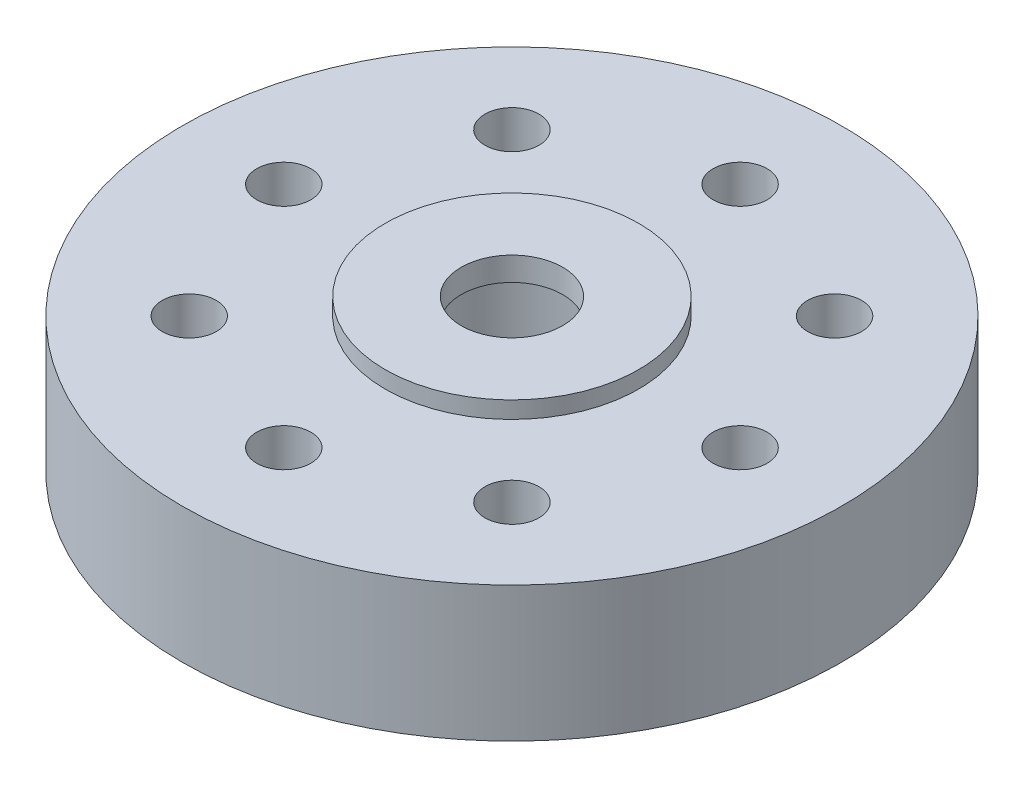
ISO-10303-21;
HEADER;
FILE_DESCRIPTION(('STEP AP214'),'2;1');
FILE_NAME('part.step','',(''),(''),'','','');
FILE_SCHEMA(('AUTOMOTIVE_DESIGN { 1 0 10303 214 1 1 1 1 }'));
ENDSEC;
DATA;
#1=APPLICATION_CONTEXT('core data for automotive mechanical design processes');
#2=APPLICATION_PROTOCOL_DEFINITION('international standard','automotive_design',2000,#1);
#3=PRODUCT_CONTEXT('',#1,'mechanical');
#4=PRODUCT('Part','Part','',(#3));
#5=PRODUCT_RELATED_PRODUCT_CATEGORY('part','',(#4));
#6=PRODUCT_DEFINITION_FORMATION('','',#4);
#7=PRODUCT_DEFINITION_CONTEXT('part definition',#1,'design');
#8=PRODUCT_DEFINITION('design','',#6,#7);
#9=PRODUCT_DEFINITION_SHAPE('','',#8);
#10=(LENGTH_UNIT() NAMED_UNIT(*) SI_UNIT(.MILLI.,.METRE.));
#11=(NAMED_UNIT(*) PLANE_ANGLE_UNIT() SI_UNIT($,.RADIAN.));
#12=(NAMED_UNIT(*) SI_UNIT($,.STERADIAN.) SOLID_ANGLE_UNIT());
#13=UNCERTAINTY_MEASURE_WITH_UNIT(LENGTH_MEASURE(1.E-05),#10,'distance_accuracy_value','');
#14=(GEOMETRIC_REPRESENTATION_CONTEXT(3) GLOBAL_UNCERTAINTY_ASSIGNED_CONTEXT((#13)) GLOBAL_UNIT_ASSIGNED_CONTEXT((#10,
#11,#12)) REPRESENTATION_CONTEXT('',''));
#15=CARTESIAN_POINT('',(0.,0.,0.));
#16=DIRECTION('',(0.,0.,1.));
#17=DIRECTION('',(1.,0.,0.));
#18=AXIS2_PLACEMENT_3D('',#15,#16,#17);
#19=CARTESIAN_POINT('',(0.,2.,0.));
#20=DIRECTION('',(0.,-1.,0.));
#21=DIRECTION('',(0.,0.,-1.));
#22=AXIS2_PLACEMENT_3D('',#19,#20,#21);
#23=CYLINDRICAL_SURFACE('',#22,1.5);
#24=CARTESIAN_POINT('',(0.,2.5,0.));
#25=DIRECTION('',(0.,1.,0.));
#26=DIRECTION('',(0.,0.,1.));
#27=AXIS2_PLACEMENT_3D('',#24,#25,#26);
#28=CIRCLE('',#27,1.5);
#29=CARTESIAN_POINT('',(0.,2.5,1.5));
#30=VERTEX_POINT('',#29);
#31=EDGE_CURVE('E253',#30,#30,#28,.T.);
#32=ORIENTED_EDGE('',*,*,#31,.T.);
#33=EDGE_LOOP('',(#32));
#34=FACE_BOUND('',#33,.T.);
#35=CARTESIAN_POINT('',(0.,1.8,0.));
#36=DIRECTION('',(0.,-1.,0.));
#37=DIRECTION('',(0.,0.,-1.));
#38=AXIS2_PLACEMENT_3D('',#35,#36,#37);
#39=CIRCLE('',#38,1.5);
#40=CARTESIAN_POINT('',(0.,1.8,-1.5));
#41=VERTEX_POINT('',#40);
#42=EDGE_CURVE('E334',#41,#41,#39,.T.);
#43=ORIENTED_EDGE('',*,*,#42,.T.);
#44=EDGE_LOOP('',(#43));
#45=FACE_BOUND('',#44,.T.);
#46=ADVANCED_FACE('F39',(#34,#45),#23,.F.);
#47=CARTESIAN_POINT('',(0.,-2.,0.));
#48=DIRECTION('',(0.,1.,0.));
#49=DIRECTION('',(0.,0.,1.));
#50=AXIS2_PLACEMENT_3D('',#47,#48,#49);
#51=PLANE('',#50);
#52=CARTESIAN_POINT('',(0.,-2.,0.));
#53=DIRECTION('',(0.,1.,0.));
#54=DIRECTION('',(0.,0.,1.));
#55=AXIS2_PLACEMENT_3D('',#52,#53,#54);
#56=CIRCLE('',#55,9.75);
#57=CARTESIAN_POINT('',(0.,-2.,9.75));
#58=VERTEX_POINT('',#57);
#59=EDGE_CURVE('E290',#58,#58,#56,.T.);
#60=ORIENTED_EDGE('',*,*,#59,.F.);
#61=EDGE_LOOP('',(#60));
#62=FACE_BOUND('',#61,.T.);
#63=CARTESIAN_POINT('',(6.75,-2.,0.));
#64=DIRECTION('',(0.,1.,0.));
#65=DIRECTION('',(0.,0.,1.));
#66=AXIS2_PLACEMENT_3D('',#63,#64,#65);
#67=CIRCLE('',#66,0.800000000000001);
#68=CARTESIAN_POINT('',(6.75,-2.,0.800000000000001));
#69=VERTEX_POINT('',#68);
#70=EDGE_CURVE('E330',#69,#69,#67,.T.);
#71=ORIENTED_EDGE('',*,*,#70,.T.);
#72=EDGE_LOOP('',(#71));
#73=FACE_BOUND('',#72,.T.);
#74=CARTESIAN_POINT('',(0.,-2.,6.75));
#75=DIRECTION('',(0.,1.,0.));
#76=DIRECTION('',(0.,0.,1.));
#77=AXIS2_PLACEMENT_3D('',#74,#75,#76);
#78=CIRCLE('',#77,0.8);
#79=CARTESIAN_POINT('',(0.,-2.,7.55));
#80=VERTEX_POINT('',#79);
#81=EDGE_CURVE('E327',#80,#80,#78,.T.);
#82=ORIENTED_EDGE('',*,*,#81,.T.);
#83=EDGE_LOOP('',(#82));
#84=FACE_BOUND('',#83,.T.);
#85=CARTESIAN_POINT('',(-6.75,-2.,0.));
#86=DIRECTION('',(0.,1.,0.));
#87=DIRECTION('',(0.,0.,1.));
#88=AXIS2_PLACEMENT_3D('',#85,#86,#87);
#89=CIRCLE('',#88,0.800000000000001);
#90=CARTESIAN_POINT('',(-6.75,-2.,0.800000000000001));
#91=VERTEX_POINT('',#90);
#92=EDGE_CURVE('E324',#91,#91,#89,.T.);
#93=ORIENTED_EDGE('',*,*,#92,.T.);
#94=EDGE_LOOP('',(#93));
#95=FACE_BOUND('',#94,.T.);
#96=CARTESIAN_POINT('',(0.,-2.,-6.75));
#97=DIRECTION('',(0.,1.,0.));
#98=DIRECTION('',(0.,0.,1.));
#99=AXIS2_PLACEMENT_3D('',#96,#97,#98);
#100=CIRCLE('',#99,0.8);
#101=CARTESIAN_POINT('',(0.,-2.,-5.95));
#102=VERTEX_POINT('',#101);
#103=EDGE_CURVE('E321',#102,#102,#100,.T.);
#104=ORIENTED_EDGE('',*,*,#103,.T.);
#105=EDGE_LOOP('',(#104));
#106=FACE_BOUND('',#105,.T.);
#107=CARTESIAN_POINT('',(4.7729707730092,-2.,4.7729707730092));
#108=DIRECTION('',(0.,1.,0.));
#109=DIRECTION('',(0.,0.,1.));
#110=AXIS2_PLACEMENT_3D('',#107,#108,#109);
#111=CIRCLE('',#110,0.800000000000001);
#112=CARTESIAN_POINT('',(4.7729707730092,-2.,5.5729707730092));
#113=VERTEX_POINT('',#112);
#114=EDGE_CURVE('E318',#113,#113,#111,.T.);
#115=ORIENTED_EDGE('',*,*,#114,.T.);
#116=EDGE_LOOP('',(#115));
#117=FACE_BOUND('',#116,.T.);
#118=CARTESIAN_POINT('',(-4.7729707730092,-2.,4.7729707730092));
#119=DIRECTION('',(0.,1.,0.));
#120=DIRECTION('',(0.,0.,1.));
#121=AXIS2_PLACEMENT_3D('',#118,#119,#120);
#122=CIRCLE('',#121,0.8);
#123=CARTESIAN_POINT('',(-4.7729707730092,-2.,5.5729707730092));
#124=VERTEX_POINT('',#123);
#125=EDGE_CURVE('E315',#124,#124,#122,.T.);
#126=ORIENTED_EDGE('',*,*,#125,.T.);
#127=EDGE_LOOP('',(#126));
#128=FACE_BOUND('',#127,.T.);
#129=CARTESIAN_POINT('',(-4.7729707730092,-2.,-4.7729707730092));
#130=DIRECTION('',(0.,1.,0.));
#131=DIRECTION('',(0.,0.,1.));
#132=AXIS2_PLACEMENT_3D('',#129,#130,#131);
#133=CIRCLE('',#132,0.8);
#134=CARTESIAN_POINT('',(-4.7729707730092,-2.,-3.97297077300919));
#135=VERTEX_POINT('',#134);
#136=EDGE_CURVE('E312',#135,#135,#133,.T.);
#137=ORIENTED_EDGE('',*,*,#136,.T.);
#138=EDGE_LOOP('',(#137));
#139=FACE_BOUND('',#138,.T.);
#140=CARTESIAN_POINT('',(4.77297077300919,-2.,-4.7729707730092));
#141=DIRECTION('',(0.,1.,0.));
#142=DIRECTION('',(0.,0.,1.));
#143=AXIS2_PLACEMENT_3D('',#140,#141,#142);
#144=CIRCLE('',#143,0.800000000000001);
#145=CARTESIAN_POINT('',(4.77297077300919,-2.,-3.9729707730092));
#146=VERTEX_POINT('',#145);
#147=EDGE_CURVE('E285',#146,#146,#144,.T.);
#148=ORIENTED_EDGE('',*,*,#147,.T.);
#149=EDGE_LOOP('',(#148));
#150=FACE_BOUND('',#149,.T.);
#151=CARTESIAN_POINT('',(4.77297077300919,-2.,4.7729707730092));
#152=DIRECTION('',(0.,-1.,0.));
#153=DIRECTION('',(0.,0.,-1.));
#154=AXIS2_PLACEMENT_3D('',#151,#152,#153);
#155=CIRCLE('',#154,2.);
#156=CARTESIAN_POINT('',(5.31331654942509,-2.,6.69859442313128));
#157=VERTEX_POINT('',#156);
#158=CARTESIAN_POINT('',(6.69859442313128,-2.,5.31331654942509));
#159=VERTEX_POINT('',#158);
#160=EDGE_CURVE('E56',#157,#159,#155,.T.);
#161=ORIENTED_EDGE('',*,*,#160,.T.);
#162=CARTESIAN_POINT('',(0.,-2.,0.));
#163=DIRECTION('',(0.,-1.,0.));
#164=DIRECTION('',(0.,0.,-1.));
#165=AXIS2_PLACEMENT_3D('',#162,#163,#164);
#166=CIRCLE('',#165,8.55);
#167=CARTESIAN_POINT('',(8.49370370370371,-2.,0.979539378325329));
#168=VERTEX_POINT('',#167);
#169=EDGE_CURVE('E227',#168,#159,#166,.T.);
#170=ORIENTED_EDGE('',*,*,#169,.F.);
#171=CARTESIAN_POINT('',(6.75,-2.,0.));
#172=DIRECTION('',(0.,-1.,0.));
#173=DIRECTION('',(0.,0.,-1.));
#174=AXIS2_PLACEMENT_3D('',#171,#172,#173);
#175=CIRCLE('',#174,2.);
#176=CARTESIAN_POINT('',(8.49370370370371,-2.,-0.979539378325329));
#177=VERTEX_POINT('',#176);
#178=EDGE_CURVE('E250',#168,#177,#175,.T.);
#179=ORIENTED_EDGE('',*,*,#178,.T.);
#180=CARTESIAN_POINT('',(6.69859442313128,-2.,-5.31331654942509));
#181=VERTEX_POINT('',#180);
#182=EDGE_CURVE('E173',#181,#177,#166,.T.);
#183=ORIENTED_EDGE('',*,*,#182,.F.);
#184=CARTESIAN_POINT('',(4.7729707730092,-2.,-4.7729707730092));
#185=DIRECTION('',(0.,-1.,0.));
#186=DIRECTION('',(0.,0.,-1.));
#187=AXIS2_PLACEMENT_3D('',#184,#185,#186);
#188=CIRCLE('',#187,2.);
#189=CARTESIAN_POINT('',(5.31331654942509,-2.,-6.69859442313128));
#190=VERTEX_POINT('',#189);
#191=EDGE_CURVE('E247',#181,#190,#188,.T.);
#192=ORIENTED_EDGE('',*,*,#191,.T.);
#193=CARTESIAN_POINT('',(0.97953937832533,-2.,-8.49370370370371));
#194=VERTEX_POINT('',#193);
#195=EDGE_CURVE('E246',#194,#190,#166,.T.);
#196=ORIENTED_EDGE('',*,*,#195,.F.);
#197=CARTESIAN_POINT('',(0.,-2.,-6.75));
#198=DIRECTION('',(0.,-1.,0.));
#199=DIRECTION('',(0.,0.,-1.));
#200=AXIS2_PLACEMENT_3D('',#197,#198,#199);
#201=CIRCLE('',#200,2.);
#202=CARTESIAN_POINT('',(-0.979539378325328,-2.,-8.49370370370371));
#203=VERTEX_POINT('',#202);
#204=EDGE_CURVE('E243',#194,#203,#201,.T.);
#205=ORIENTED_EDGE('',*,*,#204,.T.);
#206=CARTESIAN_POINT('',(-5.31331654942509,-2.,-6.69859442313128));
#207=VERTEX_POINT('',#206);
#208=EDGE_CURVE('E242',#207,#203,#166,.T.);
#209=ORIENTED_EDGE('',*,*,#208,.F.);
#210=CARTESIAN_POINT('',(-4.7729707730092,-2.,-4.7729707730092));
#211=DIRECTION('',(0.,-1.,0.));
#212=DIRECTION('',(0.,0.,-1.));
#213=AXIS2_PLACEMENT_3D('',#210,#211,#212);
#214=CIRCLE('',#213,2.);
#215=CARTESIAN_POINT('',(-6.69859442313128,-2.,-5.31331654942509));
#216=VERTEX_POINT('',#215);
#217=EDGE_CURVE('E239',#207,#216,#214,.T.);
#218=ORIENTED_EDGE('',*,*,#217,.T.);
#219=CARTESIAN_POINT('',(-8.49370370370371,-2.,-0.97953937832533));
#220=VERTEX_POINT('',#219);
#221=EDGE_CURVE('E238',#220,#216,#166,.T.);
#222=ORIENTED_EDGE('',*,*,#221,.F.);
#223=CARTESIAN_POINT('',(-6.75,-2.,0.));
#224=DIRECTION('',(0.,-1.,0.));
#225=DIRECTION('',(0.,0.,-1.));
#226=AXIS2_PLACEMENT_3D('',#223,#224,#225);
#227=CIRCLE('',#226,2.);
#228=CARTESIAN_POINT('',(-8.49370370370371,-2.,0.979539378325327));
#229=VERTEX_POINT('',#228);
#230=EDGE_CURVE('E235',#220,#229,#227,.T.);
#231=ORIENTED_EDGE('',*,*,#230,.T.);
#232=CARTESIAN_POINT('',(-6.69859442313128,-2.,5.31331654942509));
#233=VERTEX_POINT('',#232);
#234=EDGE_CURVE('E234',#233,#229,#166,.T.);
#235=ORIENTED_EDGE('',*,*,#234,.F.);
#236=CARTESIAN_POINT('',(-4.7729707730092,-2.,4.7729707730092));
#237=DIRECTION('',(0.,-1.,0.));
#238=DIRECTION('',(0.,0.,-1.));
#239=AXIS2_PLACEMENT_3D('',#236,#237,#238);
#240=CIRCLE('',#239,2.);
#241=CARTESIAN_POINT('',(-5.31331654942509,-2.,6.69859442313128));
#242=VERTEX_POINT('',#241);
#243=EDGE_CURVE('E231',#233,#242,#240,.T.);
#244=ORIENTED_EDGE('',*,*,#243,.T.);
#245=CARTESIAN_POINT('',(-0.979539378325331,-2.,8.49370370370371));
#246=VERTEX_POINT('',#245);
#247=EDGE_CURVE('E228',#246,#242,#166,.T.);
#248=ORIENTED_EDGE('',*,*,#247,.F.);
#249=CARTESIAN_POINT('',(0.,-2.,6.75));
#250=DIRECTION('',(0.,-1.,0.));
#251=DIRECTION('',(0.,0.,-1.));
#252=AXIS2_PLACEMENT_3D('',#249,#250,#251);
#253=CIRCLE('',#252,2.);
#254=CARTESIAN_POINT('',(0.979539378325327,-2.,8.49370370370371));
#255=VERTEX_POINT('',#254);
#256=EDGE_CURVE('E226',#246,#255,#253,.T.);
#257=ORIENTED_EDGE('',*,*,#256,.T.);
#258=EDGE_CURVE('E222',#157,#255,#166,.T.);
#259=ORIENTED_EDGE('',*,*,#258,.F.);
#260=EDGE_LOOP('',(#161,#170,#179,#183,#192,#196,#205,#209,#218,#222,#231,#235,#244,#248,#257,#259));
#261=FACE_BOUND('',#260,.T.);
#262=ADVANCED_FACE('F375',(#62,#73,#84,#95,#106,#117,#128,#139,#150,#261),#51,.F.);
#263=CARTESIAN_POINT('',(0.,2.,0.));
#264=DIRECTION('',(0.,-1.,0.));
#265=DIRECTION('',(0.,0.,-1.));
#266=AXIS2_PLACEMENT_3D('',#263,#264,#265);
#267=CYLINDRICAL_SURFACE('',#266,9.75);
#268=CARTESIAN_POINT('',(0.,2.,0.));
#269=DIRECTION('',(0.,1.,0.));
#270=DIRECTION('',(0.,0.,1.));
#271=AXIS2_PLACEMENT_3D('',#268,#269,#270);
#272=CIRCLE('',#271,9.75);
#273=CARTESIAN_POINT('',(0.,2.,9.75));
#274=VERTEX_POINT('',#273);
#275=EDGE_CURVE('E11',#274,#274,#272,.T.);
#276=ORIENTED_EDGE('',*,*,#275,.F.);
#277=EDGE_LOOP('',(#276));
#278=FACE_BOUND('',#277,.T.);
#279=ORIENTED_EDGE('',*,*,#59,.T.);
#280=EDGE_LOOP('',(#279));
#281=FACE_BOUND('',#280,.T.);
#282=ADVANCED_FACE('F413',(#278,#281),#267,.T.);
#283=CARTESIAN_POINT('',(6.75,2.,0.));
#284=DIRECTION('',(0.,-1.,0.));
#285=DIRECTION('',(0.,0.,-1.));
#286=AXIS2_PLACEMENT_3D('',#283,#284,#285);
#287=CYLINDRICAL_SURFACE('',#286,0.800000000000001);
#288=CARTESIAN_POINT('',(6.75,2.,0.));
#289=DIRECTION('',(0.,1.,0.));
#290=DIRECTION('',(0.,0.,1.));
#291=AXIS2_PLACEMENT_3D('',#288,#289,#290);
#292=CIRCLE('',#291,0.800000000000001);
#293=CARTESIAN_POINT('',(6.75,2.,0.800000000000001));
#294=VERTEX_POINT('',#293);
#295=EDGE_CURVE('E48',#294,#294,#292,.T.);
#296=ORIENTED_EDGE('',*,*,#295,.T.);
#297=EDGE_LOOP('',(#296));
#298=FACE_BOUND('',#297,.T.);
#299=ORIENTED_EDGE('',*,*,#70,.F.);
#300=EDGE_LOOP('',(#299));
#301=FACE_BOUND('',#300,.T.);
#302=ADVANCED_FACE('F420',(#298,#301),#287,.F.);
#303=CARTESIAN_POINT('',(0.,2.,6.75));
#304=DIRECTION('',(0.,-1.,0.));
#305=DIRECTION('',(0.,0.,-1.));
#306=AXIS2_PLACEMENT_3D('',#303,#304,#305);
#307=CYLINDRICAL_SURFACE('',#306,0.8);
#308=CARTESIAN_POINT('',(0.,2.,6.75));
#309=DIRECTION('',(0.,1.,0.));
#310=DIRECTION('',(0.,0.,1.));
#311=AXIS2_PLACEMENT_3D('',#308,#309,#310);
#312=CIRCLE('',#311,0.8);
#313=CARTESIAN_POINT('',(0.,2.,7.55));
#314=VERTEX_POINT('',#313);
#315=EDGE_CURVE('E305',#314,#314,#312,.T.);
#316=ORIENTED_EDGE('',*,*,#315,.T.);
#317=EDGE_LOOP('',(#316));
#318=FACE_BOUND('',#317,.T.);
#319=ORIENTED_EDGE('',*,*,#81,.F.);
#320=EDGE_LOOP('',(#319));
#321=FACE_BOUND('',#320,.T.);
#322=ADVANCED_FACE('F424',(#318,#321),#307,.F.);
#323=CARTESIAN_POINT('',(-6.75,2.,0.));
#324=DIRECTION('',(0.,-1.,0.));
#325=DIRECTION('',(0.,0.,-1.));
#326=AXIS2_PLACEMENT_3D('',#323,#324,#325);
#327=CYLINDRICAL_SURFACE('',#326,0.800000000000001);
#328=CARTESIAN_POINT('',(-6.75,2.,0.));
#329=DIRECTION('',(0.,1.,0.));
#330=DIRECTION('',(0.,0.,1.));
#331=AXIS2_PLACEMENT_3D('',#328,#329,#330);
#332=CIRCLE('',#331,0.800000000000001);
#333=CARTESIAN_POINT('',(-6.75,2.,0.800000000000001));
#334=VERTEX_POINT('',#333);
#335=EDGE_CURVE('E302',#334,#334,#332,.T.);
#336=ORIENTED_EDGE('',*,*,#335,.T.);
#337=EDGE_LOOP('',(#336));
#338=FACE_BOUND('',#337,.T.);
#339=ORIENTED_EDGE('',*,*,#92,.F.);
#340=EDGE_LOOP('',(#339));
#341=FACE_BOUND('',#340,.T.);
#342=ADVANCED_FACE('F428',(#338,#341),#327,.F.);
#343=CARTESIAN_POINT('',(0.,2.,-6.75));
#344=DIRECTION('',(0.,-1.,0.));
#345=DIRECTION('',(0.,0.,-1.));
#346=AXIS2_PLACEMENT_3D('',#343,#344,#345);
#347=CYLINDRICAL_SURFACE('',#346,0.8);
#348=CARTESIAN_POINT('',(0.,2.,-6.75));
#349=DIRECTION('',(0.,1.,0.));
#350=DIRECTION('',(0.,0.,1.));
#351=AXIS2_PLACEMENT_3D('',#348,#349,#350);
#352=CIRCLE('',#351,0.8);
#353=CARTESIAN_POINT('',(0.,2.,-5.95));
#354=VERTEX_POINT('',#353);
#355=EDGE_CURVE('E299',#354,#354,#352,.T.);
#356=ORIENTED_EDGE('',*,*,#355,.T.);
#357=EDGE_LOOP('',(#356));
#358=FACE_BOUND('',#357,.T.);
#359=ORIENTED_EDGE('',*,*,#103,.F.);
#360=EDGE_LOOP('',(#359));
#361=FACE_BOUND('',#360,.T.);
#362=ADVANCED_FACE('F432',(#358,#361),#347,.F.);
#363=CARTESIAN_POINT('',(4.7729707730092,2.,4.7729707730092));
#364=DIRECTION('',(0.,-1.,0.));
#365=DIRECTION('',(0.,0.,-1.));
#366=AXIS2_PLACEMENT_3D('',#363,#364,#365);
#367=CYLINDRICAL_SURFACE('',#366,0.800000000000001);
#368=CARTESIAN_POINT('',(4.7729707730092,2.,4.7729707730092));
#369=DIRECTION('',(0.,1.,0.));
#370=DIRECTION('',(0.,0.,1.));
#371=AXIS2_PLACEMENT_3D('',#368,#369,#370);
#372=CIRCLE('',#371,0.800000000000001);
#373=CARTESIAN_POINT('',(4.7729707730092,2.,5.5729707730092));
#374=VERTEX_POINT('',#373);
#375=EDGE_CURVE('E296',#374,#374,#372,.T.);
#376=ORIENTED_EDGE('',*,*,#375,.T.);
#377=EDGE_LOOP('',(#376));
#378=FACE_BOUND('',#377,.T.);
#379=ORIENTED_EDGE('',*,*,#114,.F.);
#380=EDGE_LOOP('',(#379));
#381=FACE_BOUND('',#380,.T.);
#382=ADVANCED_FACE('F436',(#378,#381),#367,.F.);
#383=CARTESIAN_POINT('',(-4.7729707730092,2.,4.7729707730092));
#384=DIRECTION('',(0.,-1.,0.));
#385=DIRECTION('',(0.,0.,-1.));
#386=AXIS2_PLACEMENT_3D('',#383,#384,#385);
#387=CYLINDRICAL_SURFACE('',#386,0.8);
#388=CARTESIAN_POINT('',(-4.7729707730092,2.,4.7729707730092));
#389=DIRECTION('',(0.,1.,0.));
#390=DIRECTION('',(0.,0.,1.));
#391=AXIS2_PLACEMENT_3D('',#388,#389,#390);
#392=CIRCLE('',#391,0.8);
#393=CARTESIAN_POINT('',(-4.7729707730092,2.,5.5729707730092));
#394=VERTEX_POINT('',#393);
#395=EDGE_CURVE('E293',#394,#394,#392,.T.);
#396=ORIENTED_EDGE('',*,*,#395,.T.);
#397=EDGE_LOOP('',(#396));
#398=FACE_BOUND('',#397,.T.);
#399=ORIENTED_EDGE('',*,*,#125,.F.);
#400=EDGE_LOOP('',(#399));
#401=FACE_BOUND('',#400,.T.);
#402=ADVANCED_FACE('F440',(#398,#401),#387,.F.);
#403=CARTESIAN_POINT('',(-4.7729707730092,2.,-4.7729707730092));
#404=DIRECTION('',(0.,-1.,0.));
#405=DIRECTION('',(0.,0.,-1.));
#406=AXIS2_PLACEMENT_3D('',#403,#404,#405);
#407=CYLINDRICAL_SURFACE('',#406,0.8);
#408=CARTESIAN_POINT('',(-4.7729707730092,2.,-4.7729707730092));
#409=DIRECTION('',(0.,1.,0.));
#410=DIRECTION('',(0.,0.,1.));
#411=AXIS2_PLACEMENT_3D('',#408,#409,#410);
#412=CIRCLE('',#411,0.8);
#413=CARTESIAN_POINT('',(-4.7729707730092,2.,-3.97297077300919));
#414=VERTEX_POINT('',#413);
#415=EDGE_CURVE('E289',#414,#414,#412,.T.);
#416=ORIENTED_EDGE('',*,*,#415,.T.);
#417=EDGE_LOOP('',(#416));
#418=FACE_BOUND('',#417,.T.);
#419=ORIENTED_EDGE('',*,*,#136,.F.);
#420=EDGE_LOOP('',(#419));
#421=FACE_BOUND('',#420,.T.);
#422=ADVANCED_FACE('F443',(#418,#421),#407,.F.);
#423=CARTESIAN_POINT('',(4.77297077300919,2.,-4.7729707730092));
#424=DIRECTION('',(0.,-1.,0.));
#425=DIRECTION('',(0.,0.,-1.));
#426=AXIS2_PLACEMENT_3D('',#423,#424,#425);
#427=CYLINDRICAL_SURFACE('',#426,0.800000000000001);
#428=CARTESIAN_POINT('',(4.77297077300919,2.,-4.7729707730092));
#429=DIRECTION('',(0.,1.,0.));
#430=DIRECTION('',(0.,0.,1.));
#431=AXIS2_PLACEMENT_3D('',#428,#429,#430);
#432=CIRCLE('',#431,0.800000000000001);
#433=CARTESIAN_POINT('',(4.77297077300919,2.,-3.9729707730092));
#434=VERTEX_POINT('',#433);
#435=EDGE_CURVE('E286',#434,#434,#432,.T.);
#436=ORIENTED_EDGE('',*,*,#435,.T.);
#437=EDGE_LOOP('',(#436));
#438=FACE_BOUND('',#437,.T.);
#439=ORIENTED_EDGE('',*,*,#147,.F.);
#440=EDGE_LOOP('',(#439));
#441=FACE_BOUND('',#440,.T.);
#442=ADVANCED_FACE('F41',(#438,#441),#427,.F.);
#443=CARTESIAN_POINT('',(0.,2.,0.));
#444=DIRECTION('',(0.,1.,0.));
#445=DIRECTION('',(0.,0.,1.));
#446=AXIS2_PLACEMENT_3D('',#443,#444,#445);
#447=PLANE('',#446);
#448=CARTESIAN_POINT('',(0.,2.,0.));
#449=DIRECTION('',(0.,1.,0.));
#450=DIRECTION('',(0.,0.,1.));
#451=AXIS2_PLACEMENT_3D('',#448,#449,#450);
#452=CIRCLE('',#451,3.75);
#453=CARTESIAN_POINT('',(0.,2.,3.75));
#454=VERTEX_POINT('',#453);
#455=EDGE_CURVE('E282',#454,#454,#452,.F.);
#456=ORIENTED_EDGE('',*,*,#455,.T.);
#457=EDGE_LOOP('',(#456));
#458=FACE_BOUND('',#457,.T.);
#459=ORIENTED_EDGE('',*,*,#435,.F.);
#460=EDGE_LOOP('',(#459));
#461=FACE_BOUND('',#460,.T.);
#462=ORIENTED_EDGE('',*,*,#415,.F.);
#463=EDGE_LOOP('',(#462));
#464=FACE_BOUND('',#463,.T.);
#465=ORIENTED_EDGE('',*,*,#395,.F.);
#466=EDGE_LOOP('',(#465));
#467=FACE_BOUND('',#466,.T.);
#468=ORIENTED_EDGE('',*,*,#375,.F.);
#469=EDGE_LOOP('',(#468));
#470=FACE_BOUND('',#469,.T.);
#471=ORIENTED_EDGE('',*,*,#355,.F.);
#472=EDGE_LOOP('',(#471));
#473=FACE_BOUND('',#472,.T.);
#474=ORIENTED_EDGE('',*,*,#335,.F.);
#475=EDGE_LOOP('',(#474));
#476=FACE_BOUND('',#475,.T.);
#477=ORIENTED_EDGE('',*,*,#315,.F.);
#478=EDGE_LOOP('',(#477));
#479=FACE_BOUND('',#478,.T.);
#480=ORIENTED_EDGE('',*,*,#295,.F.);
#481=EDGE_LOOP('',(#480));
#482=FACE_BOUND('',#481,.T.);
#483=ORIENTED_EDGE('',*,*,#275,.T.);
#484=EDGE_LOOP('',(#483));
#485=FACE_BOUND('',#484,.T.);
#486=ADVANCED_FACE('F450',(#458,#461,#464,#467,#470,#473,#476,#479,#482,#485),#447,.T.);
#487=CARTESIAN_POINT('',(0.,-2.5,0.));
#488=DIRECTION('',(0.,1.,0.));
#489=DIRECTION('',(0.,0.,1.));
#490=AXIS2_PLACEMENT_3D('',#487,#488,#489);
#491=PLANE('',#490);
#492=CARTESIAN_POINT('',(0.,-2.5,0.));
#493=DIRECTION('',(0.,1.,0.));
#494=DIRECTION('',(0.,0.,1.));
#495=AXIS2_PLACEMENT_3D('',#492,#493,#494);
#496=CIRCLE('',#495,2.5);
#497=CARTESIAN_POINT('',(0.,-2.5,2.5));
#498=VERTEX_POINT('',#497);
#499=EDGE_CURVE('E43',#498,#498,#496,.T.);
#500=ORIENTED_EDGE('',*,*,#499,.T.);
#501=EDGE_LOOP('',(#500));
#502=FACE_BOUND('',#501,.T.);
#503=CARTESIAN_POINT('',(0.,-2.5,0.));
#504=DIRECTION('',(0.,-1.,0.));
#505=DIRECTION('',(0.,0.,-1.));
#506=AXIS2_PLACEMENT_3D('',#503,#504,#505);
#507=CIRCLE('',#506,4.4);
#508=CARTESIAN_POINT('',(0.,-2.5,-4.4));
#509=VERTEX_POINT('',#508);
#510=EDGE_CURVE('E223',#509,#509,#507,.T.);
#511=ORIENTED_EDGE('',*,*,#510,.T.);
#512=EDGE_LOOP('',(#511));
#513=FACE_BOUND('',#512,.T.);
#514=ADVANCED_FACE('F462',(#502,#513),#491,.F.);
#515=CARTESIAN_POINT('',(0.,2.5,0.));
#516=DIRECTION('',(0.,-1.,0.));
#517=DIRECTION('',(0.,0.,-1.));
#518=AXIS2_PLACEMENT_3D('',#515,#516,#517);
#519=CYLINDRICAL_SURFACE('',#518,3.75);
#520=ORIENTED_EDGE('',*,*,#455,.F.);
#521=EDGE_LOOP('',(#520));
#522=FACE_BOUND('',#521,.T.);
#523=CARTESIAN_POINT('',(0.,2.5,0.));
#524=DIRECTION('',(0.,1.,0.));
#525=DIRECTION('',(0.,0.,1.));
#526=AXIS2_PLACEMENT_3D('',#523,#524,#525);
#527=CIRCLE('',#526,3.75);
#528=CARTESIAN_POINT('',(0.,2.5,3.75));
#529=VERTEX_POINT('',#528);
#530=EDGE_CURVE('E279',#529,#529,#527,.T.);
#531=ORIENTED_EDGE('',*,*,#530,.F.);
#532=EDGE_LOOP('',(#531));
#533=FACE_BOUND('',#532,.T.);
#534=ADVANCED_FACE('F500',(#522,#533),#519,.T.);
#535=CARTESIAN_POINT('',(0.,2.5,0.));
#536=DIRECTION('',(0.,1.,0.));
#537=DIRECTION('',(0.,0.,1.));
#538=AXIS2_PLACEMENT_3D('',#535,#536,#537);
#539=PLANE('',#538);
#540=ORIENTED_EDGE('',*,*,#31,.F.);
#541=EDGE_LOOP('',(#540));
#542=FACE_BOUND('',#541,.T.);
#543=ORIENTED_EDGE('',*,*,#530,.T.);
#544=EDGE_LOOP('',(#543));
#545=FACE_BOUND('',#544,.T.);
#546=ADVANCED_FACE('F506',(#542,#545),#539,.T.);
#547=CARTESIAN_POINT('',(4.77297077300919,1.8,4.7729707730092));
#548=DIRECTION('',(0.,-1.,0.));
#549=DIRECTION('',(0.,0.,-1.));
#550=AXIS2_PLACEMENT_3D('',#547,#548,#549);
#551=CYLINDRICAL_SURFACE('',#550,2.);
#552=ORIENTED_EDGE('',*,*,#160,.F.);
#553=DIRECTION('',(0.,-1.,0.));
#554=VECTOR('',#553,1.);
#555=CARTESIAN_POINT('',(5.31331654942509,1.8,6.69859442313128));
#556=LINE('',#555,#554);
#557=CARTESIAN_POINT('',(5.31331654942509,1.8,6.69859442313128));
#558=VERTEX_POINT('',#557);
#559=EDGE_CURVE('E116',#558,#157,#556,.T.);
#560=ORIENTED_EDGE('',*,*,#559,.F.);
#561=CARTESIAN_POINT('',(4.77297077300919,1.8,4.7729707730092));
#562=DIRECTION('',(0.,-1.,0.));
#563=DIRECTION('',(0.,0.,-1.));
#564=AXIS2_PLACEMENT_3D('',#561,#562,#563);
#565=CIRCLE('',#564,2.);
#566=CARTESIAN_POINT('',(6.69859442313128,1.8,5.31331654942509));
#567=VERTEX_POINT('',#566);
#568=EDGE_CURVE('E62',#558,#567,#565,.T.);
#569=ORIENTED_EDGE('',*,*,#568,.T.);
#570=DIRECTION('',(0.,-1.,0.));
#571=VECTOR('',#570,1.);
#572=CARTESIAN_POINT('',(6.69859442313128,1.8,5.31331654942509));
#573=LINE('',#572,#571);
#574=EDGE_CURVE('E112',#567,#159,#573,.T.);
#575=ORIENTED_EDGE('',*,*,#574,.T.);
#576=EDGE_LOOP('',(#552,#560,#569,#575));
#577=FACE_BOUND('',#576,.T.);
#578=ADVANCED_FACE('F511',(#577),#551,.T.);
#579=CARTESIAN_POINT('',(0.,1.8,0.));
#580=DIRECTION('',(0.,-1.,0.));
#581=DIRECTION('',(0.,0.,-1.));
#582=AXIS2_PLACEMENT_3D('',#579,#580,#581);
#583=CYLINDRICAL_SURFACE('',#582,8.55);
#584=ORIENTED_EDGE('',*,*,#169,.T.);
#585=ORIENTED_EDGE('',*,*,#574,.F.);
#586=CARTESIAN_POINT('',(0.,1.8,0.));
#587=DIRECTION('',(0.,-1.,0.));
#588=DIRECTION('',(0.,0.,-1.));
#589=AXIS2_PLACEMENT_3D('',#586,#587,#588);
#590=CIRCLE('',#589,8.55);
#591=CARTESIAN_POINT('',(8.49370370370371,1.8,0.979539378325329));
#592=VERTEX_POINT('',#591);
#593=EDGE_CURVE('E166',#592,#567,#590,.T.);
#594=ORIENTED_EDGE('',*,*,#593,.F.);
#595=DIRECTION('',(0.,-1.,0.));
#596=VECTOR('',#595,1.);
#597=CARTESIAN_POINT('',(8.49370370370371,1.8,0.979539378325329));
#598=LINE('',#597,#596);
#599=EDGE_CURVE('E161',#592,#168,#598,.T.);
#600=ORIENTED_EDGE('',*,*,#599,.T.);
#601=EDGE_LOOP('',(#584,#585,#594,#600));
#602=FACE_BOUND('',#601,.T.);
#603=ADVANCED_FACE('F402',(#602),#583,.F.);
#604=CARTESIAN_POINT('',(6.75,1.8,0.));
#605=DIRECTION('',(0.,-1.,0.));
#606=DIRECTION('',(0.,0.,-1.));
#607=AXIS2_PLACEMENT_3D('',#604,#605,#606);
#608=CYLINDRICAL_SURFACE('',#607,2.);
#609=ORIENTED_EDGE('',*,*,#178,.F.);
#610=ORIENTED_EDGE('',*,*,#599,.F.);
#611=CARTESIAN_POINT('',(6.75,1.8,0.));
#612=DIRECTION('',(0.,-1.,0.));
#613=DIRECTION('',(0.,0.,-1.));
#614=AXIS2_PLACEMENT_3D('',#611,#612,#613);
#615=CIRCLE('',#614,2.);
#616=CARTESIAN_POINT('',(8.49370370370371,1.8,-0.979539378325329));
#617=VERTEX_POINT('',#616);
#618=EDGE_CURVE('E155',#592,#617,#615,.T.);
#619=ORIENTED_EDGE('',*,*,#618,.T.);
#620=DIRECTION('',(0.,-1.,0.));
#621=VECTOR('',#620,1.);
#622=CARTESIAN_POINT('',(8.49370370370371,1.8,-0.979539378325329));
#623=LINE('',#622,#621);
#624=EDGE_CURVE('E159',#617,#177,#623,.T.);
#625=ORIENTED_EDGE('',*,*,#624,.T.);
#626=EDGE_LOOP('',(#609,#610,#619,#625));
#627=FACE_BOUND('',#626,.T.);
#628=ADVANCED_FACE('F158',(#627),#608,.T.);
#629=ORIENTED_EDGE('',*,*,#182,.T.);
#630=ORIENTED_EDGE('',*,*,#624,.F.);
#631=CARTESIAN_POINT('',(6.69859442313128,1.8,-5.31331654942509));
#632=VERTEX_POINT('',#631);
#633=EDGE_CURVE('E167',#632,#617,#590,.T.);
#634=ORIENTED_EDGE('',*,*,#633,.F.);
#635=DIRECTION('',(0.,-1.,0.));
#636=VECTOR('',#635,1.);
#637=CARTESIAN_POINT('',(6.69859442313128,1.8,-5.31331654942509));
#638=LINE('',#637,#636);
#639=EDGE_CURVE('E175',#632,#181,#638,.T.);
#640=ORIENTED_EDGE('',*,*,#639,.T.);
#641=EDGE_LOOP('',(#629,#630,#634,#640));
#642=FACE_BOUND('',#641,.T.);
#643=ADVANCED_FACE('F171',(#642),#583,.F.);
#644=CARTESIAN_POINT('',(4.7729707730092,1.8,-4.7729707730092));
#645=DIRECTION('',(0.,-1.,0.));
#646=DIRECTION('',(0.,0.,-1.));
#647=AXIS2_PLACEMENT_3D('',#644,#645,#646);
#648=CYLINDRICAL_SURFACE('',#647,2.);
#649=ORIENTED_EDGE('',*,*,#191,.F.);
#650=ORIENTED_EDGE('',*,*,#639,.F.);
#651=CARTESIAN_POINT('',(4.7729707730092,1.8,-4.7729707730092));
#652=DIRECTION('',(0.,-1.,0.));
#653=DIRECTION('',(0.,0.,-1.));
#654=AXIS2_PLACEMENT_3D('',#651,#652,#653);
#655=CIRCLE('',#654,2.);
#656=CARTESIAN_POINT('',(5.31331654942509,1.8,-6.69859442313128));
#657=VERTEX_POINT('',#656);
#658=EDGE_CURVE('E180',#632,#657,#655,.T.);
#659=ORIENTED_EDGE('',*,*,#658,.T.);
#660=DIRECTION('',(0.,-1.,0.));
#661=VECTOR('',#660,1.);
#662=CARTESIAN_POINT('',(5.31331654942509,1.8,-6.69859442313128));
#663=LINE('',#662,#661);
#664=EDGE_CURVE('E256',#657,#190,#663,.T.);
#665=ORIENTED_EDGE('',*,*,#664,.T.);
#666=EDGE_LOOP('',(#649,#650,#659,#665));
#667=FACE_BOUND('',#666,.T.);
#668=ADVANCED_FACE('F391',(#667),#648,.T.);
#669=ORIENTED_EDGE('',*,*,#195,.T.);
#670=ORIENTED_EDGE('',*,*,#664,.F.);
#671=CARTESIAN_POINT('',(0.97953937832533,1.8,-8.49370370370371));
#672=VERTEX_POINT('',#671);
#673=EDGE_CURVE('E182',#672,#657,#590,.T.);
#674=ORIENTED_EDGE('',*,*,#673,.F.);
#675=DIRECTION('',(0.,-1.,0.));
#676=VECTOR('',#675,1.);
#677=CARTESIAN_POINT('',(0.97953937832533,1.8,-8.49370370370371));
#678=LINE('',#677,#676);
#679=EDGE_CURVE('E258',#672,#194,#678,.T.);
#680=ORIENTED_EDGE('',*,*,#679,.T.);
#681=EDGE_LOOP('',(#669,#670,#674,#680));
#682=FACE_BOUND('',#681,.T.);
#683=ADVANCED_FACE('F393',(#682),#583,.F.);
#684=CARTESIAN_POINT('',(0.,1.8,-6.75));
#685=DIRECTION('',(0.,-1.,0.));
#686=DIRECTION('',(0.,0.,-1.));
#687=AXIS2_PLACEMENT_3D('',#684,#685,#686);
#688=CYLINDRICAL_SURFACE('',#687,2.);
#689=ORIENTED_EDGE('',*,*,#204,.F.);
#690=ORIENTED_EDGE('',*,*,#679,.F.);
#691=CARTESIAN_POINT('',(0.,1.8,-6.75));
#692=DIRECTION('',(0.,-1.,0.));
#693=DIRECTION('',(0.,0.,-1.));
#694=AXIS2_PLACEMENT_3D('',#691,#692,#693);
#695=CIRCLE('',#694,2.);
#696=CARTESIAN_POINT('',(-0.979539378325328,1.8,-8.49370370370371));
#697=VERTEX_POINT('',#696);
#698=EDGE_CURVE('E187',#672,#697,#695,.T.);
#699=ORIENTED_EDGE('',*,*,#698,.T.);
#700=DIRECTION('',(0.,-1.,0.));
#701=VECTOR('',#700,1.);
#702=CARTESIAN_POINT('',(-0.979539378325328,1.8,-8.49370370370371));
#703=LINE('',#702,#701);
#704=EDGE_CURVE('E260',#697,#203,#703,.T.);
#705=ORIENTED_EDGE('',*,*,#704,.T.);
#706=EDGE_LOOP('',(#689,#690,#699,#705));
#707=FACE_BOUND('',#706,.T.);
#708=ADVANCED_FACE('F388',(#707),#688,.T.);
#709=ORIENTED_EDGE('',*,*,#208,.T.);
#710=ORIENTED_EDGE('',*,*,#704,.F.);
#711=CARTESIAN_POINT('',(-5.31331654942509,1.8,-6.69859442313128));
#712=VERTEX_POINT('',#711);
#713=EDGE_CURVE('E188',#712,#697,#590,.T.);
#714=ORIENTED_EDGE('',*,*,#713,.F.);
#715=DIRECTION('',(0.,-1.,0.));
#716=VECTOR('',#715,1.);
#717=CARTESIAN_POINT('',(-5.31331654942509,1.8,-6.69859442313128));
#718=LINE('',#717,#716);
#719=EDGE_CURVE('E262',#712,#207,#718,.T.);
#720=ORIENTED_EDGE('',*,*,#719,.T.);
#721=EDGE_LOOP('',(#709,#710,#714,#720));
#722=FACE_BOUND('',#721,.T.);
#723=ADVANCED_FACE('F386',(#722),#583,.F.);
#724=CARTESIAN_POINT('',(-4.7729707730092,1.8,-4.7729707730092));
#725=DIRECTION('',(0.,-1.,0.));
#726=DIRECTION('',(0.,0.,-1.));
#727=AXIS2_PLACEMENT_3D('',#724,#725,#726);
#728=CYLINDRICAL_SURFACE('',#727,2.);
#729=ORIENTED_EDGE('',*,*,#217,.F.);
#730=ORIENTED_EDGE('',*,*,#719,.F.);
#731=CARTESIAN_POINT('',(-4.7729707730092,1.8,-4.7729707730092));
#732=DIRECTION('',(0.,-1.,0.));
#733=DIRECTION('',(0.,0.,-1.));
#734=AXIS2_PLACEMENT_3D('',#731,#732,#733);
#735=CIRCLE('',#734,2.);
#736=CARTESIAN_POINT('',(-6.69859442313128,1.8,-5.31331654942509));
#737=VERTEX_POINT('',#736);
#738=EDGE_CURVE('E210',#712,#737,#735,.T.);
#739=ORIENTED_EDGE('',*,*,#738,.T.);
#740=DIRECTION('',(0.,-1.,0.));
#741=VECTOR('',#740,1.);
#742=CARTESIAN_POINT('',(-6.69859442313128,1.8,-5.31331654942509));
#743=LINE('',#742,#741);
#744=EDGE_CURVE('E264',#737,#216,#743,.T.);
#745=ORIENTED_EDGE('',*,*,#744,.T.);
#746=EDGE_LOOP('',(#729,#730,#739,#745));
#747=FACE_BOUND('',#746,.T.);
#748=ADVANCED_FACE('F385',(#747),#728,.T.);
#749=ORIENTED_EDGE('',*,*,#221,.T.);
#750=ORIENTED_EDGE('',*,*,#744,.F.);
#751=CARTESIAN_POINT('',(-8.49370370370371,1.8,-0.97953937832533));
#752=VERTEX_POINT('',#751);
#753=EDGE_CURVE('E205',#752,#737,#590,.T.);
#754=ORIENTED_EDGE('',*,*,#753,.F.);
#755=DIRECTION('',(0.,-1.,0.));
#756=VECTOR('',#755,1.);
#757=CARTESIAN_POINT('',(-8.49370370370371,1.8,-0.97953937832533));
#758=LINE('',#757,#756);
#759=EDGE_CURVE('E266',#752,#220,#758,.T.);
#760=ORIENTED_EDGE('',*,*,#759,.T.);
#761=EDGE_LOOP('',(#749,#750,#754,#760));
#762=FACE_BOUND('',#761,.T.);
#763=ADVANCED_FACE('F382',(#762),#583,.F.);
#764=CARTESIAN_POINT('',(-6.75,1.8,0.));
#765=DIRECTION('',(0.,-1.,0.));
#766=DIRECTION('',(0.,0.,-1.));
#767=AXIS2_PLACEMENT_3D('',#764,#765,#766);
#768=CYLINDRICAL_SURFACE('',#767,2.);
#769=ORIENTED_EDGE('',*,*,#230,.F.);
#770=ORIENTED_EDGE('',*,*,#759,.F.);
#771=CARTESIAN_POINT('',(-6.75,1.8,0.));
#772=DIRECTION('',(0.,-1.,0.));
#773=DIRECTION('',(0.,0.,-1.));
#774=AXIS2_PLACEMENT_3D('',#771,#772,#773);
#775=CIRCLE('',#774,2.);
#776=CARTESIAN_POINT('',(-8.49370370370371,1.8,0.979539378325327));
#777=VERTEX_POINT('',#776);
#778=EDGE_CURVE('E204',#752,#777,#775,.T.);
#779=ORIENTED_EDGE('',*,*,#778,.T.);
#780=DIRECTION('',(0.,-1.,0.));
#781=VECTOR('',#780,1.);
#782=CARTESIAN_POINT('',(-8.49370370370371,1.8,0.979539378325327));
#783=LINE('',#782,#781);
#784=EDGE_CURVE('E268',#777,#229,#783,.T.);
#785=ORIENTED_EDGE('',*,*,#784,.T.);
#786=EDGE_LOOP('',(#769,#770,#779,#785));
#787=FACE_BOUND('',#786,.T.);
#788=ADVANCED_FACE('F381',(#787),#768,.T.);
#789=ORIENTED_EDGE('',*,*,#234,.T.);
#790=ORIENTED_EDGE('',*,*,#784,.F.);
#791=CARTESIAN_POINT('',(-6.69859442313128,1.8,5.31331654942509));
#792=VERTEX_POINT('',#791);
#793=EDGE_CURVE('E199',#792,#777,#590,.T.);
#794=ORIENTED_EDGE('',*,*,#793,.F.);
#795=DIRECTION('',(0.,-1.,0.));
#796=VECTOR('',#795,1.);
#797=CARTESIAN_POINT('',(-6.69859442313128,1.8,5.31331654942509));
#798=LINE('',#797,#796);
#799=EDGE_CURVE('E270',#792,#233,#798,.T.);
#800=ORIENTED_EDGE('',*,*,#799,.T.);
#801=EDGE_LOOP('',(#789,#790,#794,#800));
#802=FACE_BOUND('',#801,.T.);
#803=ADVANCED_FACE('F378',(#802),#583,.F.);
#804=CARTESIAN_POINT('',(-4.7729707730092,1.8,4.7729707730092));
#805=DIRECTION('',(0.,-1.,0.));
#806=DIRECTION('',(0.,0.,-1.));
#807=AXIS2_PLACEMENT_3D('',#804,#805,#806);
#808=CYLINDRICAL_SURFACE('',#807,2.);
#809=ORIENTED_EDGE('',*,*,#243,.F.);
#810=ORIENTED_EDGE('',*,*,#799,.F.);
#811=CARTESIAN_POINT('',(-4.7729707730092,1.8,4.7729707730092));
#812=DIRECTION('',(0.,-1.,0.));
#813=DIRECTION('',(0.,0.,-1.));
#814=AXIS2_PLACEMENT_3D('',#811,#812,#813);
#815=CIRCLE('',#814,2.);
#816=CARTESIAN_POINT('',(-5.31331654942509,1.8,6.69859442313128));
#817=VERTEX_POINT('',#816);
#818=EDGE_CURVE('E198',#792,#817,#815,.T.);
#819=ORIENTED_EDGE('',*,*,#818,.T.);
#820=DIRECTION('',(0.,-1.,0.));
#821=VECTOR('',#820,1.);
#822=CARTESIAN_POINT('',(-5.31331654942509,1.8,6.69859442313128));
#823=LINE('',#822,#821);
#824=EDGE_CURVE('E272',#817,#242,#823,.T.);
#825=ORIENTED_EDGE('',*,*,#824,.T.);
#826=EDGE_LOOP('',(#809,#810,#819,#825));
#827=FACE_BOUND('',#826,.T.);
#828=ADVANCED_FACE('F377',(#827),#808,.T.);
#829=ORIENTED_EDGE('',*,*,#247,.T.);
#830=ORIENTED_EDGE('',*,*,#824,.F.);
#831=CARTESIAN_POINT('',(-0.979539378325331,1.8,8.49370370370371));
#832=VERTEX_POINT('',#831);
#833=EDGE_CURVE('E193',#832,#817,#590,.T.);
#834=ORIENTED_EDGE('',*,*,#833,.F.);
#835=DIRECTION('',(0.,-1.,0.));
#836=VECTOR('',#835,1.);
#837=CARTESIAN_POINT('',(-0.979539378325331,1.8,8.49370370370371));
#838=LINE('',#837,#836);
#839=EDGE_CURVE('E274',#832,#246,#838,.T.);
#840=ORIENTED_EDGE('',*,*,#839,.T.);
#841=EDGE_LOOP('',(#829,#830,#834,#840));
#842=FACE_BOUND('',#841,.T.);
#843=ADVANCED_FACE('F371',(#842),#583,.F.);
#844=CARTESIAN_POINT('',(0.,1.8,6.75));
#845=DIRECTION('',(0.,-1.,0.));
#846=DIRECTION('',(0.,0.,-1.));
#847=AXIS2_PLACEMENT_3D('',#844,#845,#846);
#848=CYLINDRICAL_SURFACE('',#847,2.);
#849=ORIENTED_EDGE('',*,*,#256,.F.);
#850=ORIENTED_EDGE('',*,*,#839,.F.);
#851=CARTESIAN_POINT('',(0.,1.8,6.75));
#852=DIRECTION('',(0.,-1.,0.));
#853=DIRECTION('',(0.,0.,-1.));
#854=AXIS2_PLACEMENT_3D('',#851,#852,#853);
#855=CIRCLE('',#854,2.);
#856=CARTESIAN_POINT('',(0.979539378325327,1.8,8.49370370370371));
#857=VERTEX_POINT('',#856);
#858=EDGE_CURVE('E192',#832,#857,#855,.T.);
#859=ORIENTED_EDGE('',*,*,#858,.T.);
#860=DIRECTION('',(0.,-1.,0.));
#861=VECTOR('',#860,1.);
#862=CARTESIAN_POINT('',(0.979539378325327,1.8,8.49370370370371));
#863=LINE('',#862,#861);
#864=EDGE_CURVE('E189',#857,#255,#863,.T.);
#865=ORIENTED_EDGE('',*,*,#864,.T.);
#866=EDGE_LOOP('',(#849,#850,#859,#865));
#867=FACE_BOUND('',#866,.T.);
#868=ADVANCED_FACE('F517',(#867),#848,.T.);
#869=CARTESIAN_POINT('',(0.,1.8,0.));
#870=DIRECTION('',(0.,-1.,0.));
#871=DIRECTION('',(0.,0.,-1.));
#872=AXIS2_PLACEMENT_3D('',#869,#870,#871);
#873=CYLINDRICAL_SURFACE('',#872,4.4);
#874=CARTESIAN_POINT('',(0.,1.8,0.));
#875=DIRECTION('',(0.,-1.,0.));
#876=DIRECTION('',(0.,0.,-1.));
#877=AXIS2_PLACEMENT_3D('',#874,#875,#876);
#878=CIRCLE('',#877,4.4);
#879=CARTESIAN_POINT('',(0.,1.8,-4.4));
#880=VERTEX_POINT('',#879);
#881=EDGE_CURVE('E196',#880,#880,#878,.T.);
#882=ORIENTED_EDGE('',*,*,#881,.T.);
#883=EDGE_LOOP('',(#882));
#884=FACE_BOUND('',#883,.T.);
#885=ORIENTED_EDGE('',*,*,#510,.F.);
#886=EDGE_LOOP('',(#885));
#887=FACE_BOUND('',#886,.T.);
#888=ADVANCED_FACE('F513',(#884,#887),#873,.T.);
#889=ORIENTED_EDGE('',*,*,#258,.T.);
#890=ORIENTED_EDGE('',*,*,#864,.F.);
#891=EDGE_CURVE('E184',#558,#857,#590,.T.);
#892=ORIENTED_EDGE('',*,*,#891,.F.);
#893=ORIENTED_EDGE('',*,*,#559,.T.);
#894=EDGE_LOOP('',(#889,#890,#892,#893));
#895=FACE_BOUND('',#894,.T.);
#896=ADVANCED_FACE('F516',(#895),#583,.F.);
#897=CARTESIAN_POINT('',(0.,1.8,0.));
#898=DIRECTION('',(0.,-1.,0.));
#899=DIRECTION('',(0.,0.,-1.));
#900=AXIS2_PLACEMENT_3D('',#897,#898,#899);
#901=PLANE('',#900);
#902=ORIENTED_EDGE('',*,*,#881,.F.);
#903=EDGE_LOOP('',(#902));
#904=FACE_BOUND('',#903,.T.);
#905=ORIENTED_EDGE('',*,*,#568,.F.);
#906=ORIENTED_EDGE('',*,*,#891,.T.);
#907=ORIENTED_EDGE('',*,*,#858,.F.);
#908=ORIENTED_EDGE('',*,*,#833,.T.);
#909=ORIENTED_EDGE('',*,*,#818,.F.);
#910=ORIENTED_EDGE('',*,*,#793,.T.);
#911=ORIENTED_EDGE('',*,*,#778,.F.);
#912=ORIENTED_EDGE('',*,*,#753,.T.);
#913=ORIENTED_EDGE('',*,*,#738,.F.);
#914=ORIENTED_EDGE('',*,*,#713,.T.);
#915=ORIENTED_EDGE('',*,*,#698,.F.);
#916=ORIENTED_EDGE('',*,*,#673,.T.);
#917=ORIENTED_EDGE('',*,*,#658,.F.);
#918=ORIENTED_EDGE('',*,*,#633,.T.);
#919=ORIENTED_EDGE('',*,*,#618,.F.);
#920=ORIENTED_EDGE('',*,*,#593,.T.);
#921=EDGE_LOOP('',(#905,#906,#907,#908,#909,#910,#911,#912,#913,#914,#915,#916,#917,#918,#919,#920));
#922=FACE_BOUND('',#921,.T.);
#923=ADVANCED_FACE('F178',(#904,#922),#901,.T.);
#924=CARTESIAN_POINT('',(0.,1.8,0.));
#925=DIRECTION('',(0.,-1.,0.));
#926=DIRECTION('',(0.,0.,-1.));
#927=AXIS2_PLACEMENT_3D('',#924,#925,#926);
#928=CYLINDRICAL_SURFACE('',#927,2.5);
#929=CARTESIAN_POINT('',(0.,1.8,0.));
#930=DIRECTION('',(0.,-1.,0.));
#931=DIRECTION('',(0.,0.,-1.));
#932=AXIS2_PLACEMENT_3D('',#929,#930,#931);
#933=CIRCLE('',#932,2.5);
#934=CARTESIAN_POINT('',(0.,1.8,-2.5));
#935=VERTEX_POINT('',#934);
#936=EDGE_CURVE('E336',#935,#935,#933,.T.);
#937=ORIENTED_EDGE('',*,*,#936,.F.);
#938=EDGE_LOOP('',(#937));
#939=FACE_BOUND('',#938,.T.);
#940=ORIENTED_EDGE('',*,*,#499,.F.);
#941=EDGE_LOOP('',(#940));
#942=FACE_BOUND('',#941,.T.);
#943=ADVANCED_FACE('F539',(#939,#942),#928,.F.);
#944=CARTESIAN_POINT('',(0.,1.8,0.));
#945=DIRECTION('',(0.,-1.,0.));
#946=DIRECTION('',(0.,0.,-1.));
#947=AXIS2_PLACEMENT_3D('',#944,#945,#946);
#948=PLANE('',#947);
#949=ORIENTED_EDGE('',*,*,#42,.F.);
#950=EDGE_LOOP('',(#949));
#951=FACE_BOUND('',#950,.T.);
#952=ORIENTED_EDGE('',*,*,#936,.T.);
#953=EDGE_LOOP('',(#952));
#954=FACE_BOUND('',#953,.T.);
#955=ADVANCED_FACE('F617',(#951,#954),#948,.T.);
#956=CLOSED_SHELL('',(#46,#262,#282,#302,#322,#342,#362,#382,#402,#422,#442,#486,#514,#534,#546,
#578,#603,#628,#643,#668,#683,#708,#723,#748,#763,#788,#803,#828,#843,#868,#888,#896,#923,#943,#955));
#957=MANIFOLD_SOLID_BREP('B2',#956);
#958=ADVANCED_BREP_SHAPE_REPRESENTATION('',(#18,#957),#14);
#959=SHAPE_DEFINITION_REPRESENTATION(#9,#958);
ENDSEC;
END-ISO-10303-21;
